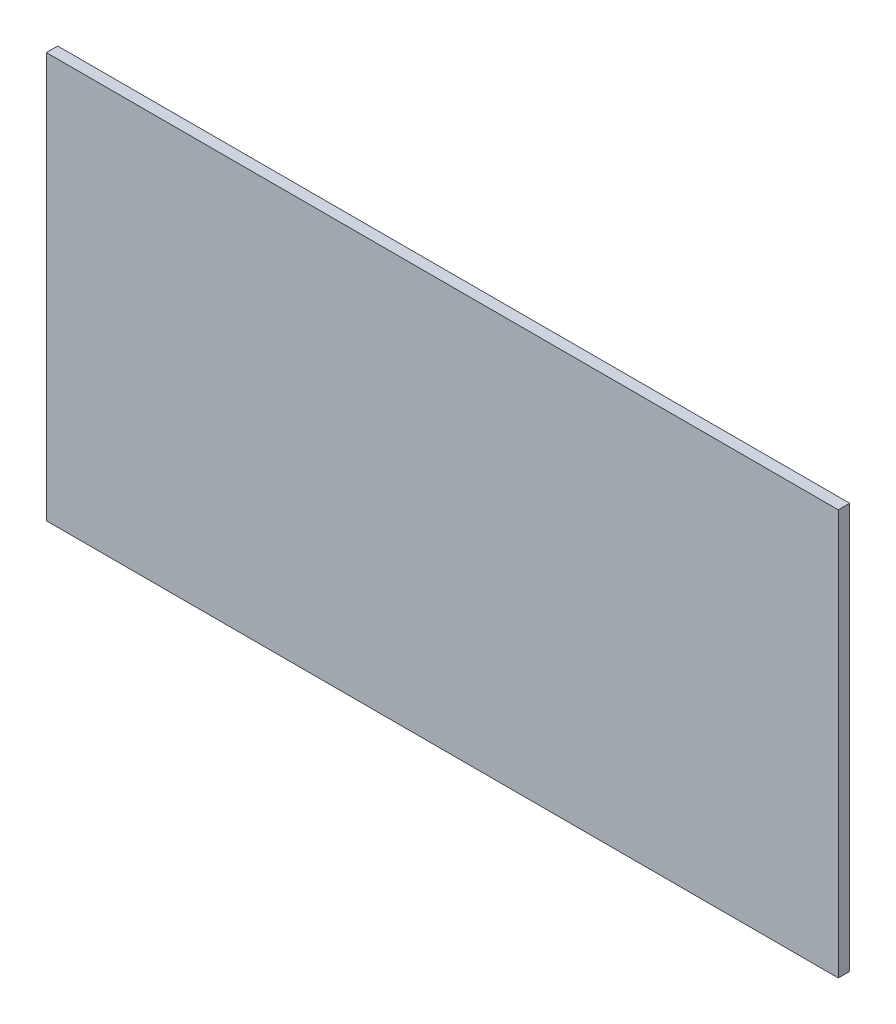
ISO-10303-21;
HEADER;
FILE_DESCRIPTION(('STEP AP214'),'2;1');
FILE_NAME('part.step','',(''),(''),'','','');
FILE_SCHEMA(('AUTOMOTIVE_DESIGN { 1 0 10303 214 1 1 1 1 }'));
ENDSEC;
DATA;
#1=APPLICATION_CONTEXT('core data for automotive mechanical design processes');
#2=APPLICATION_PROTOCOL_DEFINITION('international standard','automotive_design',2000,#1);
#3=PRODUCT_CONTEXT('',#1,'mechanical');
#4=PRODUCT('Part','Part','',(#3));
#5=PRODUCT_RELATED_PRODUCT_CATEGORY('part','',(#4));
#6=PRODUCT_DEFINITION_FORMATION('','',#4);
#7=PRODUCT_DEFINITION_CONTEXT('part definition',#1,'design');
#8=PRODUCT_DEFINITION('design','',#6,#7);
#9=PRODUCT_DEFINITION_SHAPE('','',#8);
#10=(LENGTH_UNIT() NAMED_UNIT(*) SI_UNIT(.MILLI.,.METRE.));
#11=(NAMED_UNIT(*) PLANE_ANGLE_UNIT() SI_UNIT($,.RADIAN.));
#12=(NAMED_UNIT(*) SI_UNIT($,.STERADIAN.) SOLID_ANGLE_UNIT());
#13=UNCERTAINTY_MEASURE_WITH_UNIT(LENGTH_MEASURE(1.E-05),#10,'distance_accuracy_value','');
#14=(GEOMETRIC_REPRESENTATION_CONTEXT(3) GLOBAL_UNCERTAINTY_ASSIGNED_CONTEXT((#13)) GLOBAL_UNIT_ASSIGNED_CONTEXT((#10,
#11,#12)) REPRESENTATION_CONTEXT('',''));
#15=CARTESIAN_POINT('',(0.,0.,0.));
#16=DIRECTION('',(0.,0.,1.));
#17=DIRECTION('',(1.,0.,0.));
#18=AXIS2_PLACEMENT_3D('',#15,#16,#17);
#19=CARTESIAN_POINT('',(104.5,-53.5,3.));
#20=DIRECTION('',(-1.,0.,0.));
#21=DIRECTION('',(0.,0.,1.));
#22=AXIS2_PLACEMENT_3D('',#19,#20,#21);
#23=PLANE('',#22);
#24=DIRECTION('',(0.,1.,0.));
#25=VECTOR('',#24,1.);
#26=CARTESIAN_POINT('',(104.5,-53.5,0.));
#27=LINE('',#26,#25);
#28=CARTESIAN_POINT('',(104.5,-53.5,0.));
#29=VERTEX_POINT('',#28);
#30=CARTESIAN_POINT('',(104.5,53.5,0.));
#31=VERTEX_POINT('',#30);
#32=EDGE_CURVE('E111',#29,#31,#27,.T.);
#33=ORIENTED_EDGE('',*,*,#32,.T.);
#34=DIRECTION('',(0.,0.,-1.));
#35=VECTOR('',#34,1.);
#36=CARTESIAN_POINT('',(104.5,53.5,3.));
#37=LINE('',#36,#35);
#38=CARTESIAN_POINT('',(104.5,53.5,3.));
#39=VERTEX_POINT('',#38);
#40=EDGE_CURVE('E11',#39,#31,#37,.T.);
#41=ORIENTED_EDGE('',*,*,#40,.F.);
#42=DIRECTION('',(0.,1.,0.));
#43=VECTOR('',#42,1.);
#44=CARTESIAN_POINT('',(104.5,-53.5,3.));
#45=LINE('',#44,#43);
#46=CARTESIAN_POINT('',(104.5,-53.5,3.));
#47=VERTEX_POINT('',#46);
#48=EDGE_CURVE('E95',#47,#39,#45,.T.);
#49=ORIENTED_EDGE('',*,*,#48,.F.);
#50=DIRECTION('',(0.,0.,-1.));
#51=VECTOR('',#50,1.);
#52=CARTESIAN_POINT('',(104.5,-53.5,3.));
#53=LINE('',#52,#51);
#54=EDGE_CURVE('E107',#47,#29,#53,.T.);
#55=ORIENTED_EDGE('',*,*,#54,.T.);
#56=EDGE_LOOP('',(#33,#41,#49,#55));
#57=FACE_BOUND('',#56,.T.);
#58=ADVANCED_FACE('F43',(#57),#23,.F.);
#59=CARTESIAN_POINT('',(-104.5,53.5,3.));
#60=DIRECTION('',(0.,-1.,0.));
#61=DIRECTION('',(0.,0.,-1.));
#62=AXIS2_PLACEMENT_3D('',#59,#60,#61);
#63=PLANE('',#62);
#64=DIRECTION('',(-1.,0.,0.));
#65=VECTOR('',#64,1.);
#66=CARTESIAN_POINT('',(-104.5,53.5,0.));
#67=LINE('',#66,#65);
#68=CARTESIAN_POINT('',(-104.5,53.5,0.));
#69=VERTEX_POINT('',#68);
#70=EDGE_CURVE('E100',#31,#69,#67,.T.);
#71=ORIENTED_EDGE('',*,*,#70,.T.);
#72=DIRECTION('',(0.,0.,-1.));
#73=VECTOR('',#72,1.);
#74=CARTESIAN_POINT('',(-104.5,53.5,3.));
#75=LINE('',#74,#73);
#76=CARTESIAN_POINT('',(-104.5,53.5,3.));
#77=VERTEX_POINT('',#76);
#78=EDGE_CURVE('E52',#77,#69,#75,.T.);
#79=ORIENTED_EDGE('',*,*,#78,.F.);
#80=DIRECTION('',(-1.,0.,0.));
#81=VECTOR('',#80,1.);
#82=CARTESIAN_POINT('',(-104.5,53.5,3.));
#83=LINE('',#82,#81);
#84=EDGE_CURVE('E90',#39,#77,#83,.T.);
#85=ORIENTED_EDGE('',*,*,#84,.F.);
#86=ORIENTED_EDGE('',*,*,#40,.T.);
#87=EDGE_LOOP('',(#71,#79,#85,#86));
#88=FACE_BOUND('',#87,.T.);
#89=ADVANCED_FACE('F99',(#88),#63,.F.);
#90=CARTESIAN_POINT('',(-104.5,-53.5,3.));
#91=DIRECTION('',(1.,0.,0.));
#92=DIRECTION('',(0.,0.,-1.));
#93=AXIS2_PLACEMENT_3D('',#90,#91,#92);
#94=PLANE('',#93);
#95=DIRECTION('',(0.,-1.,0.));
#96=VECTOR('',#95,1.);
#97=CARTESIAN_POINT('',(-104.5,-53.5,0.));
#98=LINE('',#97,#96);
#99=CARTESIAN_POINT('',(-104.5,-53.5,0.));
#100=VERTEX_POINT('',#99);
#101=EDGE_CURVE('E77',#69,#100,#98,.T.);
#102=ORIENTED_EDGE('',*,*,#101,.T.);
#103=DIRECTION('',(0.,0.,-1.));
#104=VECTOR('',#103,1.);
#105=CARTESIAN_POINT('',(-104.5,-53.5,3.));
#106=LINE('',#105,#104);
#107=CARTESIAN_POINT('',(-104.5,-53.5,3.));
#108=VERTEX_POINT('',#107);
#109=EDGE_CURVE('E102',#108,#100,#106,.T.);
#110=ORIENTED_EDGE('',*,*,#109,.F.);
#111=DIRECTION('',(0.,-1.,0.));
#112=VECTOR('',#111,1.);
#113=CARTESIAN_POINT('',(-104.5,-53.5,3.));
#114=LINE('',#113,#112);
#115=EDGE_CURVE('E93',#77,#108,#114,.T.);
#116=ORIENTED_EDGE('',*,*,#115,.F.);
#117=ORIENTED_EDGE('',*,*,#78,.T.);
#118=EDGE_LOOP('',(#102,#110,#116,#117));
#119=FACE_BOUND('',#118,.T.);
#120=ADVANCED_FACE('F103',(#119),#94,.F.);
#121=CARTESIAN_POINT('',(-104.5,-53.5,3.));
#122=DIRECTION('',(0.,1.,0.));
#123=DIRECTION('',(0.,0.,1.));
#124=AXIS2_PLACEMENT_3D('',#121,#122,#123);
#125=PLANE('',#124);
#126=DIRECTION('',(1.,0.,0.));
#127=VECTOR('',#126,1.);
#128=CARTESIAN_POINT('',(-104.5,-53.5,0.));
#129=LINE('',#128,#127);
#130=EDGE_CURVE('E83',#100,#29,#129,.T.);
#131=ORIENTED_EDGE('',*,*,#130,.T.);
#132=ORIENTED_EDGE('',*,*,#54,.F.);
#133=DIRECTION('',(1.,0.,0.));
#134=VECTOR('',#133,1.);
#135=CARTESIAN_POINT('',(-104.5,-53.5,3.));
#136=LINE('',#135,#134);
#137=EDGE_CURVE('E60',#108,#47,#136,.T.);
#138=ORIENTED_EDGE('',*,*,#137,.F.);
#139=ORIENTED_EDGE('',*,*,#109,.T.);
#140=EDGE_LOOP('',(#131,#132,#138,#139));
#141=FACE_BOUND('',#140,.T.);
#142=ADVANCED_FACE('F124',(#141),#125,.F.);
#143=CARTESIAN_POINT('',(0.,0.,3.));
#144=DIRECTION('',(0.,0.,-1.));
#145=DIRECTION('',(-1.,0.,0.));
#146=AXIS2_PLACEMENT_3D('',#143,#144,#145);
#147=PLANE('',#146);
#148=ORIENTED_EDGE('',*,*,#48,.T.);
#149=ORIENTED_EDGE('',*,*,#84,.T.);
#150=ORIENTED_EDGE('',*,*,#115,.T.);
#151=ORIENTED_EDGE('',*,*,#137,.T.);
#152=EDGE_LOOP('',(#148,#149,#150,#151));
#153=FACE_BOUND('',#152,.T.);
#154=ADVANCED_FACE('F91',(#153),#147,.F.);
#155=CARTESIAN_POINT('',(0.,0.,0.));
#156=DIRECTION('',(0.,0.,-1.));
#157=DIRECTION('',(-1.,0.,0.));
#158=AXIS2_PLACEMENT_3D('',#155,#156,#157);
#159=PLANE('',#158);
#160=ORIENTED_EDGE('',*,*,#32,.F.);
#161=ORIENTED_EDGE('',*,*,#130,.F.);
#162=ORIENTED_EDGE('',*,*,#101,.F.);
#163=ORIENTED_EDGE('',*,*,#70,.F.);
#164=EDGE_LOOP('',(#160,#161,#162,#163));
#165=FACE_BOUND('',#164,.T.);
#166=ADVANCED_FACE('F127',(#165),#159,.T.);
#167=CLOSED_SHELL('',(#58,#89,#120,#142,#154,#166));
#168=MANIFOLD_SOLID_BREP('B2',#167);
#169=ADVANCED_BREP_SHAPE_REPRESENTATION('',(#18,#168),#14);
#170=SHAPE_DEFINITION_REPRESENTATION(#9,#169);
ENDSEC;
END-ISO-10303-21;
